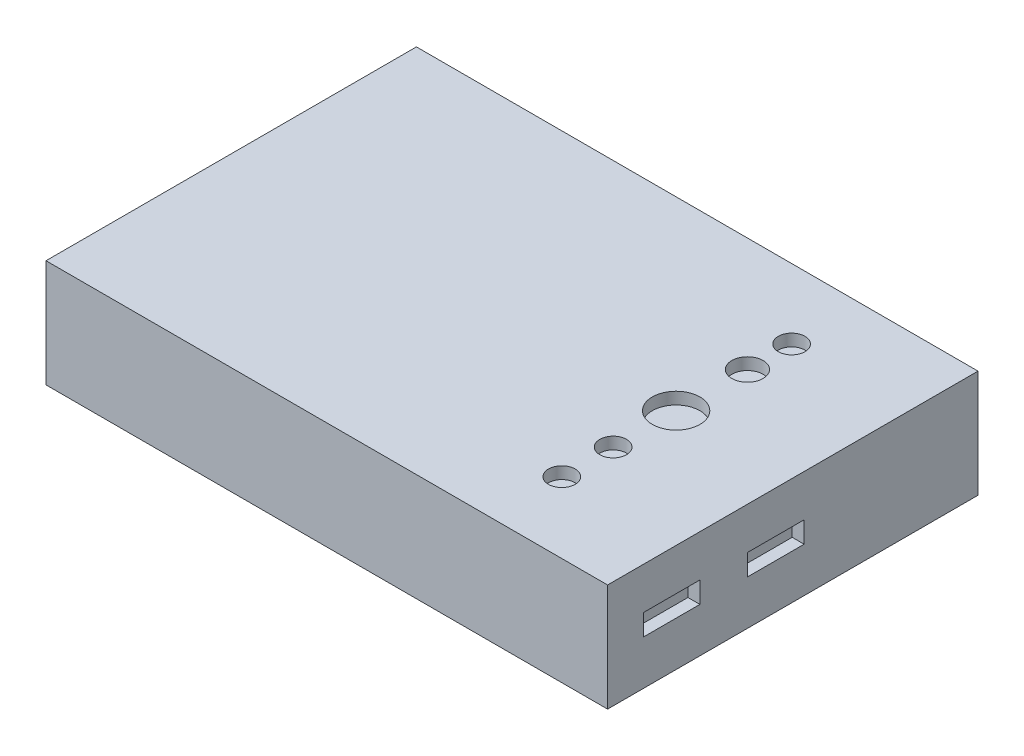
ISO-10303-21;
HEADER;
FILE_DESCRIPTION(('STEP AP214'),'2;1');
FILE_NAME('part.step','',(''),(''),'','','');
FILE_SCHEMA(('AUTOMOTIVE_DESIGN { 1 0 10303 214 1 1 1 1 }'));
ENDSEC;
DATA;
#1=APPLICATION_CONTEXT('core data for automotive mechanical design processes');
#2=APPLICATION_PROTOCOL_DEFINITION('international standard','automotive_design',2000,#1);
#3=PRODUCT_CONTEXT('',#1,'mechanical');
#4=PRODUCT('Part','Part','',(#3));
#5=PRODUCT_RELATED_PRODUCT_CATEGORY('part','',(#4));
#6=PRODUCT_DEFINITION_FORMATION('','',#4);
#7=PRODUCT_DEFINITION_CONTEXT('part definition',#1,'design');
#8=PRODUCT_DEFINITION('design','',#6,#7);
#9=PRODUCT_DEFINITION_SHAPE('','',#8);
#10=(LENGTH_UNIT() NAMED_UNIT(*) SI_UNIT(.MILLI.,.METRE.));
#11=(NAMED_UNIT(*) PLANE_ANGLE_UNIT() SI_UNIT($,.RADIAN.));
#12=(NAMED_UNIT(*) SI_UNIT($,.STERADIAN.) SOLID_ANGLE_UNIT());
#13=UNCERTAINTY_MEASURE_WITH_UNIT(LENGTH_MEASURE(1.E-05),#10,'distance_accuracy_value','');
#14=(GEOMETRIC_REPRESENTATION_CONTEXT(3) GLOBAL_UNCERTAINTY_ASSIGNED_CONTEXT((#13)) GLOBAL_UNIT_ASSIGNED_CONTEXT((#10,
#11,#12)) REPRESENTATION_CONTEXT('',''));
#15=CARTESIAN_POINT('',(0.,0.,0.));
#16=DIRECTION('',(0.,0.,1.));
#17=DIRECTION('',(1.,0.,0.));
#18=AXIS2_PLACEMENT_3D('',#15,#16,#17);
#19=CARTESIAN_POINT('',(0.,22.86,0.));
#20=DIRECTION('',(1.,0.,0.));
#21=DIRECTION('',(0.,0.,-1.));
#22=AXIS2_PLACEMENT_3D('',#19,#20,#21);
#23=PLANE('',#22);
#24=DIRECTION('',(0.,0.,1.));
#25=VECTOR('',#24,1.);
#26=CARTESIAN_POINT('',(0.,0.,0.));
#27=LINE('',#26,#25);
#28=CARTESIAN_POINT('',(0.,0.,-78.74));
#29=VERTEX_POINT('',#28);
#30=CARTESIAN_POINT('',(0.,0.,0.));
#31=VERTEX_POINT('',#30);
#32=EDGE_CURVE('E160',#29,#31,#27,.T.);
#33=ORIENTED_EDGE('',*,*,#32,.T.);
#34=DIRECTION('',(0.,-1.,0.));
#35=VECTOR('',#34,1.);
#36=CARTESIAN_POINT('',(0.,22.86,0.));
#37=LINE('',#36,#35);
#38=CARTESIAN_POINT('',(0.,22.86,0.));
#39=VERTEX_POINT('',#38);
#40=EDGE_CURVE('E11',#39,#31,#37,.T.);
#41=ORIENTED_EDGE('',*,*,#40,.F.);
#42=DIRECTION('',(0.,0.,1.));
#43=VECTOR('',#42,1.);
#44=CARTESIAN_POINT('',(0.,22.86,0.));
#45=LINE('',#44,#43);
#46=CARTESIAN_POINT('',(0.,22.86,-78.74));
#47=VERTEX_POINT('',#46);
#48=EDGE_CURVE('E194',#47,#39,#45,.T.);
#49=ORIENTED_EDGE('',*,*,#48,.F.);
#50=DIRECTION('',(0.,-1.,0.));
#51=VECTOR('',#50,1.);
#52=CARTESIAN_POINT('',(0.,22.86,-78.74));
#53=LINE('',#52,#51);
#54=EDGE_CURVE('E204',#47,#29,#53,.T.);
#55=ORIENTED_EDGE('',*,*,#54,.T.);
#56=EDGE_LOOP('',(#33,#41,#49,#55));
#57=FACE_BOUND('',#56,.T.);
#58=ADVANCED_FACE('F33',(#57),#23,.F.);
#59=CARTESIAN_POINT('',(0.,22.86,0.));
#60=DIRECTION('',(0.,0.,-1.));
#61=DIRECTION('',(-1.,0.,0.));
#62=AXIS2_PLACEMENT_3D('',#59,#60,#61);
#63=PLANE('',#62);
#64=DIRECTION('',(1.,0.,0.));
#65=VECTOR('',#64,1.);
#66=CARTESIAN_POINT('',(0.,0.,0.));
#67=LINE('',#66,#65);
#68=CARTESIAN_POINT('',(119.38,0.,0.));
#69=VERTEX_POINT('',#68);
#70=EDGE_CURVE('E207',#31,#69,#67,.T.);
#71=ORIENTED_EDGE('',*,*,#70,.T.);
#72=DIRECTION('',(0.,-1.,0.));
#73=VECTOR('',#72,1.);
#74=CARTESIAN_POINT('',(119.38,22.86,0.));
#75=LINE('',#74,#73);
#76=CARTESIAN_POINT('',(119.38,22.86,0.));
#77=VERTEX_POINT('',#76);
#78=EDGE_CURVE('E40',#77,#69,#75,.T.);
#79=ORIENTED_EDGE('',*,*,#78,.F.);
#80=DIRECTION('',(1.,0.,0.));
#81=VECTOR('',#80,1.);
#82=CARTESIAN_POINT('',(0.,22.86,0.));
#83=LINE('',#82,#81);
#84=EDGE_CURVE('E197',#39,#77,#83,.T.);
#85=ORIENTED_EDGE('',*,*,#84,.F.);
#86=ORIENTED_EDGE('',*,*,#40,.T.);
#87=EDGE_LOOP('',(#71,#79,#85,#86));
#88=FACE_BOUND('',#87,.T.);
#89=ADVANCED_FACE('F237',(#88),#63,.F.);
#90=CARTESIAN_POINT('',(119.38,22.86,0.));
#91=DIRECTION('',(-1.,0.,0.));
#92=DIRECTION('',(0.,0.,1.));
#93=AXIS2_PLACEMENT_3D('',#90,#91,#92);
#94=PLANE('',#93);
#95=DIRECTION('',(0.,0.,-1.));
#96=VECTOR('',#95,1.);
#97=CARTESIAN_POINT('',(119.38,9.47,-7.62));
#98=LINE('',#97,#96);
#99=CARTESIAN_POINT('',(119.38,9.47,-7.62));
#100=VERTEX_POINT('',#99);
#101=CARTESIAN_POINT('',(119.38,9.47,-19.62));
#102=VERTEX_POINT('',#101);
#103=EDGE_CURVE('E153',#100,#102,#98,.T.);
#104=ORIENTED_EDGE('',*,*,#103,.F.);
#105=DIRECTION('',(0.,-1.,0.));
#106=VECTOR('',#105,1.);
#107=CARTESIAN_POINT('',(119.38,13.97,-7.62));
#108=LINE('',#107,#106);
#109=CARTESIAN_POINT('',(119.38,13.97,-7.62));
#110=VERTEX_POINT('',#109);
#111=EDGE_CURVE('E47',#110,#100,#108,.T.);
#112=ORIENTED_EDGE('',*,*,#111,.F.);
#113=DIRECTION('',(0.,0.,1.));
#114=VECTOR('',#113,1.);
#115=CARTESIAN_POINT('',(119.38,13.97,-7.62));
#116=LINE('',#115,#114);
#117=CARTESIAN_POINT('',(119.38,13.97,-19.62));
#118=VERTEX_POINT('',#117);
#119=EDGE_CURVE('E141',#118,#110,#116,.T.);
#120=ORIENTED_EDGE('',*,*,#119,.F.);
#121=DIRECTION('',(0.,1.,0.));
#122=VECTOR('',#121,1.);
#123=CARTESIAN_POINT('',(119.38,13.97,-19.62));
#124=LINE('',#123,#122);
#125=EDGE_CURVE('E144',#102,#118,#124,.T.);
#126=ORIENTED_EDGE('',*,*,#125,.F.);
#127=EDGE_LOOP('',(#104,#112,#120,#126));
#128=FACE_BOUND('',#127,.T.);
#129=DIRECTION('',(0.,0.,-1.));
#130=VECTOR('',#129,1.);
#131=CARTESIAN_POINT('',(119.38,9.47,-29.78));
#132=LINE('',#131,#130);
#133=CARTESIAN_POINT('',(119.38,9.47,-29.78));
#134=VERTEX_POINT('',#133);
#135=CARTESIAN_POINT('',(119.38,9.47,-41.78));
#136=VERTEX_POINT('',#135);
#137=EDGE_CURVE('E179',#134,#136,#132,.T.);
#138=ORIENTED_EDGE('',*,*,#137,.F.);
#139=DIRECTION('',(0.,-1.,0.));
#140=VECTOR('',#139,1.);
#141=CARTESIAN_POINT('',(119.38,13.97,-29.78));
#142=LINE('',#141,#140);
#143=CARTESIAN_POINT('',(119.38,13.97,-29.78));
#144=VERTEX_POINT('',#143);
#145=EDGE_CURVE('E55',#144,#134,#142,.T.);
#146=ORIENTED_EDGE('',*,*,#145,.F.);
#147=DIRECTION('',(0.,0.,1.));
#148=VECTOR('',#147,1.);
#149=CARTESIAN_POINT('',(119.38,13.97,-29.78));
#150=LINE('',#149,#148);
#151=CARTESIAN_POINT('',(119.38,13.97,-41.78));
#152=VERTEX_POINT('',#151);
#153=EDGE_CURVE('E168',#152,#144,#150,.T.);
#154=ORIENTED_EDGE('',*,*,#153,.F.);
#155=DIRECTION('',(0.,1.,0.));
#156=VECTOR('',#155,1.);
#157=CARTESIAN_POINT('',(119.38,13.97,-41.78));
#158=LINE('',#157,#156);
#159=EDGE_CURVE('E183',#136,#152,#158,.T.);
#160=ORIENTED_EDGE('',*,*,#159,.F.);
#161=EDGE_LOOP('',(#138,#146,#154,#160));
#162=FACE_BOUND('',#161,.T.);
#163=DIRECTION('',(0.,0.,-1.));
#164=VECTOR('',#163,1.);
#165=CARTESIAN_POINT('',(119.38,0.,0.));
#166=LINE('',#165,#164);
#167=CARTESIAN_POINT('',(119.38,0.,-78.74));
#168=VERTEX_POINT('',#167);
#169=EDGE_CURVE('E209',#69,#168,#166,.T.);
#170=ORIENTED_EDGE('',*,*,#169,.T.);
#171=DIRECTION('',(0.,-1.,0.));
#172=VECTOR('',#171,1.);
#173=CARTESIAN_POINT('',(119.38,22.86,-78.74));
#174=LINE('',#173,#172);
#175=CARTESIAN_POINT('',(119.38,22.86,-78.74));
#176=VERTEX_POINT('',#175);
#177=EDGE_CURVE('E214',#176,#168,#174,.T.);
#178=ORIENTED_EDGE('',*,*,#177,.F.);
#179=DIRECTION('',(0.,0.,-1.));
#180=VECTOR('',#179,1.);
#181=CARTESIAN_POINT('',(119.38,22.86,0.));
#182=LINE('',#181,#180);
#183=EDGE_CURVE('E200',#77,#176,#182,.T.);
#184=ORIENTED_EDGE('',*,*,#183,.F.);
#185=ORIENTED_EDGE('',*,*,#78,.T.);
#186=EDGE_LOOP('',(#170,#178,#184,#185));
#187=FACE_BOUND('',#186,.T.);
#188=ADVANCED_FACE('F221',(#128,#162,#187),#94,.F.);
#189=CARTESIAN_POINT('',(0.,22.86,-78.74));
#190=DIRECTION('',(0.,0.,1.));
#191=DIRECTION('',(1.,0.,0.));
#192=AXIS2_PLACEMENT_3D('',#189,#190,#191);
#193=PLANE('',#192);
#194=DIRECTION('',(-1.,0.,0.));
#195=VECTOR('',#194,1.);
#196=CARTESIAN_POINT('',(0.,0.,-78.74));
#197=LINE('',#196,#195);
#198=EDGE_CURVE('E198',#168,#29,#197,.T.);
#199=ORIENTED_EDGE('',*,*,#198,.T.);
#200=ORIENTED_EDGE('',*,*,#54,.F.);
#201=DIRECTION('',(-1.,0.,0.));
#202=VECTOR('',#201,1.);
#203=CARTESIAN_POINT('',(0.,22.86,-78.74));
#204=LINE('',#203,#202);
#205=EDGE_CURVE('E202',#176,#47,#204,.T.);
#206=ORIENTED_EDGE('',*,*,#205,.F.);
#207=ORIENTED_EDGE('',*,*,#177,.T.);
#208=EDGE_LOOP('',(#199,#200,#206,#207));
#209=FACE_BOUND('',#208,.T.);
#210=ADVANCED_FACE('F230',(#209),#193,.F.);
#211=CARTESIAN_POINT('',(0.,22.86,0.));
#212=DIRECTION('',(0.,-1.,0.));
#213=DIRECTION('',(0.,0.,-1.));
#214=AXIS2_PLACEMENT_3D('',#211,#212,#213);
#215=PLANE('',#214);
#216=CARTESIAN_POINT('',(94.5792176740278,22.86,-15.0744175106316));
#217=DIRECTION('',(0.,1.,0.));
#218=DIRECTION('',(0.,0.,1.));
#219=AXIS2_PLACEMENT_3D('',#216,#217,#218);
#220=CIRCLE('',#219,2.83689681457869);
#221=CARTESIAN_POINT('',(94.5792176740278,22.86,-12.2375206960529));
#222=VERTEX_POINT('',#221);
#223=EDGE_CURVE('E351',#222,#222,#220,.T.);
#224=ORIENTED_EDGE('',*,*,#223,.F.);
#225=EDGE_LOOP('',(#224));
#226=FACE_BOUND('',#225,.T.);
#227=CARTESIAN_POINT('',(94.5792176740278,22.86,-25.9852274014185));
#228=DIRECTION('',(0.,1.,0.));
#229=DIRECTION('',(0.,0.,1.));
#230=AXIS2_PLACEMENT_3D('',#227,#228,#229);
#231=CIRCLE('',#230,2.83689681457869);
#232=CARTESIAN_POINT('',(94.5792176740278,22.86,-23.1483305868398));
#233=VERTEX_POINT('',#232);
#234=EDGE_CURVE('E345',#233,#233,#231,.T.);
#235=ORIENTED_EDGE('',*,*,#234,.F.);
#236=EDGE_LOOP('',(#235));
#237=FACE_BOUND('',#236,.T.);
#238=CARTESIAN_POINT('',(94.5792176740278,22.86,-63.9193222542705));
#239=DIRECTION('',(0.,1.,0.));
#240=DIRECTION('',(0.,0.,1.));
#241=AXIS2_PLACEMENT_3D('',#238,#239,#240);
#242=CIRCLE('',#241,2.83689681457869);
#243=CARTESIAN_POINT('',(94.5792176740278,22.86,-61.0824254396919));
#244=VERTEX_POINT('',#243);
#245=EDGE_CURVE('E339',#244,#244,#242,.T.);
#246=ORIENTED_EDGE('',*,*,#245,.F.);
#247=EDGE_LOOP('',(#246));
#248=FACE_BOUND('',#247,.T.);
#249=CARTESIAN_POINT('',(94.5792176740278,22.86,-54.5309509528958));
#250=DIRECTION('',(0.,1.,0.));
#251=DIRECTION('',(0.,0.,1.));
#252=AXIS2_PLACEMENT_3D('',#249,#250,#251);
#253=CIRCLE('',#252,3.32050258923197);
#254=CARTESIAN_POINT('',(94.5792176740278,22.86,-51.2104483636638));
#255=VERTEX_POINT('',#254);
#256=EDGE_CURVE('E330',#255,#255,#253,.T.);
#257=ORIENTED_EDGE('',*,*,#256,.F.);
#258=EDGE_LOOP('',(#257));
#259=FACE_BOUND('',#258,.T.);
#260=CARTESIAN_POINT('',(94.5792176740278,22.86,-39.37));
#261=DIRECTION('',(0.,1.,0.));
#262=DIRECTION('',(0.,0.,1.));
#263=AXIS2_PLACEMENT_3D('',#260,#261,#262);
#264=CIRCLE('',#263,5.06527111955265);
#265=CARTESIAN_POINT('',(94.5792176740278,22.86,-34.3047288804473));
#266=VERTEX_POINT('',#265);
#267=EDGE_CURVE('E147',#266,#266,#264,.T.);
#268=ORIENTED_EDGE('',*,*,#267,.F.);
#269=EDGE_LOOP('',(#268));
#270=FACE_BOUND('',#269,.T.);
#271=ORIENTED_EDGE('',*,*,#48,.T.);
#272=ORIENTED_EDGE('',*,*,#84,.T.);
#273=ORIENTED_EDGE('',*,*,#183,.T.);
#274=ORIENTED_EDGE('',*,*,#205,.T.);
#275=EDGE_LOOP('',(#271,#272,#273,#274));
#276=FACE_BOUND('',#275,.T.);
#277=ADVANCED_FACE('F236',(#226,#237,#248,#259,#270,#276),#215,.F.);
#278=CARTESIAN_POINT('',(0.,0.,0.));
#279=DIRECTION('',(0.,-1.,0.));
#280=DIRECTION('',(0.,0.,-1.));
#281=AXIS2_PLACEMENT_3D('',#278,#279,#280);
#282=PLANE('',#281);
#283=ORIENTED_EDGE('',*,*,#32,.F.);
#284=ORIENTED_EDGE('',*,*,#198,.F.);
#285=ORIENTED_EDGE('',*,*,#169,.F.);
#286=ORIENTED_EDGE('',*,*,#70,.F.);
#287=EDGE_LOOP('',(#283,#284,#285,#286));
#288=FACE_BOUND('',#287,.T.);
#289=ADVANCED_FACE('F227',(#288),#282,.T.);
#290=CARTESIAN_POINT('',(116.84,13.97,-29.78));
#291=DIRECTION('',(0.,0.,1.));
#292=DIRECTION('',(1.,0.,0.));
#293=AXIS2_PLACEMENT_3D('',#290,#291,#292);
#294=PLANE('',#293);
#295=ORIENTED_EDGE('',*,*,#145,.T.);
#296=DIRECTION('',(1.,0.,0.));
#297=VECTOR('',#296,1.);
#298=CARTESIAN_POINT('',(116.84,9.47,-29.78));
#299=LINE('',#298,#297);
#300=CARTESIAN_POINT('',(116.84,9.47,-29.78));
#301=VERTEX_POINT('',#300);
#302=EDGE_CURVE('E177',#301,#134,#299,.T.);
#303=ORIENTED_EDGE('',*,*,#302,.F.);
#304=DIRECTION('',(0.,-1.,0.));
#305=VECTOR('',#304,1.);
#306=CARTESIAN_POINT('',(116.84,13.97,-29.78));
#307=LINE('',#306,#305);
#308=CARTESIAN_POINT('',(116.84,13.97,-29.78));
#309=VERTEX_POINT('',#308);
#310=EDGE_CURVE('E164',#309,#301,#307,.T.);
#311=ORIENTED_EDGE('',*,*,#310,.F.);
#312=DIRECTION('',(1.,0.,0.));
#313=VECTOR('',#312,1.);
#314=CARTESIAN_POINT('',(116.84,13.97,-29.78));
#315=LINE('',#314,#313);
#316=EDGE_CURVE('E154',#309,#144,#315,.T.);
#317=ORIENTED_EDGE('',*,*,#316,.T.);
#318=EDGE_LOOP('',(#295,#303,#311,#317));
#319=FACE_BOUND('',#318,.T.);
#320=ADVANCED_FACE('F250',(#319),#294,.F.);
#321=CARTESIAN_POINT('',(116.84,13.97,-29.78));
#322=DIRECTION('',(0.,1.,0.));
#323=DIRECTION('',(0.,0.,1.));
#324=AXIS2_PLACEMENT_3D('',#321,#322,#323);
#325=PLANE('',#324);
#326=ORIENTED_EDGE('',*,*,#153,.T.);
#327=ORIENTED_EDGE('',*,*,#316,.F.);
#328=DIRECTION('',(0.,0.,1.));
#329=VECTOR('',#328,1.);
#330=CARTESIAN_POINT('',(116.84,13.97,-29.78));
#331=LINE('',#330,#329);
#332=CARTESIAN_POINT('',(116.84,13.97,-41.78));
#333=VERTEX_POINT('',#332);
#334=EDGE_CURVE('E174',#333,#309,#331,.T.);
#335=ORIENTED_EDGE('',*,*,#334,.F.);
#336=DIRECTION('',(1.,0.,0.));
#337=VECTOR('',#336,1.);
#338=CARTESIAN_POINT('',(116.84,13.97,-41.78));
#339=LINE('',#338,#337);
#340=EDGE_CURVE('E189',#333,#152,#339,.T.);
#341=ORIENTED_EDGE('',*,*,#340,.T.);
#342=EDGE_LOOP('',(#326,#327,#335,#341));
#343=FACE_BOUND('',#342,.T.);
#344=ADVANCED_FACE('F256',(#343),#325,.F.);
#345=CARTESIAN_POINT('',(116.84,13.97,-41.78));
#346=DIRECTION('',(0.,0.,-1.));
#347=DIRECTION('',(-1.,0.,0.));
#348=AXIS2_PLACEMENT_3D('',#345,#346,#347);
#349=PLANE('',#348);
#350=ORIENTED_EDGE('',*,*,#159,.T.);
#351=ORIENTED_EDGE('',*,*,#340,.F.);
#352=DIRECTION('',(0.,1.,0.));
#353=VECTOR('',#352,1.);
#354=CARTESIAN_POINT('',(116.84,13.97,-41.78));
#355=LINE('',#354,#353);
#356=CARTESIAN_POINT('',(116.84,9.47,-41.78));
#357=VERTEX_POINT('',#356);
#358=EDGE_CURVE('E171',#357,#333,#355,.T.);
#359=ORIENTED_EDGE('',*,*,#358,.F.);
#360=DIRECTION('',(1.,0.,0.));
#361=VECTOR('',#360,1.);
#362=CARTESIAN_POINT('',(116.84,9.47,-41.78));
#363=LINE('',#362,#361);
#364=EDGE_CURVE('E191',#357,#136,#363,.T.);
#365=ORIENTED_EDGE('',*,*,#364,.T.);
#366=EDGE_LOOP('',(#350,#351,#359,#365));
#367=FACE_BOUND('',#366,.T.);
#368=ADVANCED_FACE('F261',(#367),#349,.F.);
#369=CARTESIAN_POINT('',(116.84,9.47,-29.78));
#370=DIRECTION('',(0.,-1.,0.));
#371=DIRECTION('',(0.,0.,-1.));
#372=AXIS2_PLACEMENT_3D('',#369,#370,#371);
#373=PLANE('',#372);
#374=ORIENTED_EDGE('',*,*,#137,.T.);
#375=ORIENTED_EDGE('',*,*,#364,.F.);
#376=DIRECTION('',(0.,0.,-1.));
#377=VECTOR('',#376,1.);
#378=CARTESIAN_POINT('',(116.84,9.47,-29.78));
#379=LINE('',#378,#377);
#380=EDGE_CURVE('E167',#301,#357,#379,.T.);
#381=ORIENTED_EDGE('',*,*,#380,.F.);
#382=ORIENTED_EDGE('',*,*,#302,.T.);
#383=EDGE_LOOP('',(#374,#375,#381,#382));
#384=FACE_BOUND('',#383,.T.);
#385=ADVANCED_FACE('F257',(#384),#373,.F.);
#386=CARTESIAN_POINT('',(116.84,0.,0.));
#387=DIRECTION('',(1.,0.,0.));
#388=DIRECTION('',(0.,0.,-1.));
#389=AXIS2_PLACEMENT_3D('',#386,#387,#388);
#390=PLANE('',#389);
#391=ORIENTED_EDGE('',*,*,#310,.T.);
#392=ORIENTED_EDGE('',*,*,#380,.T.);
#393=ORIENTED_EDGE('',*,*,#358,.T.);
#394=ORIENTED_EDGE('',*,*,#334,.T.);
#395=EDGE_LOOP('',(#391,#392,#393,#394));
#396=FACE_BOUND('',#395,.T.);
#397=ADVANCED_FACE('F260',(#396),#390,.T.);
#398=CARTESIAN_POINT('',(116.84,13.97,-7.62));
#399=DIRECTION('',(0.,0.,1.));
#400=DIRECTION('',(0.,-1.,0.));
#401=AXIS2_PLACEMENT_3D('',#398,#399,#400);
#402=PLANE('',#401);
#403=ORIENTED_EDGE('',*,*,#111,.T.);
#404=DIRECTION('',(1.,0.,0.));
#405=VECTOR('',#404,1.);
#406=CARTESIAN_POINT('',(116.84,9.47,-7.62));
#407=LINE('',#406,#405);
#408=CARTESIAN_POINT('',(116.84,9.47,-7.62));
#409=VERTEX_POINT('',#408);
#410=EDGE_CURVE('E119',#409,#100,#407,.T.);
#411=ORIENTED_EDGE('',*,*,#410,.F.);
#412=DIRECTION('',(0.,-1.,0.));
#413=VECTOR('',#412,1.);
#414=CARTESIAN_POINT('',(116.84,13.97,-7.62));
#415=LINE('',#414,#413);
#416=CARTESIAN_POINT('',(116.84,13.97,-7.62));
#417=VERTEX_POINT('',#416);
#418=EDGE_CURVE('E123',#417,#409,#415,.T.);
#419=ORIENTED_EDGE('',*,*,#418,.F.);
#420=DIRECTION('',(1.,0.,0.));
#421=VECTOR('',#420,1.);
#422=CARTESIAN_POINT('',(116.84,13.97,-7.62));
#423=LINE('',#422,#421);
#424=EDGE_CURVE('E158',#417,#110,#423,.T.);
#425=ORIENTED_EDGE('',*,*,#424,.T.);
#426=EDGE_LOOP('',(#403,#411,#419,#425));
#427=FACE_BOUND('',#426,.T.);
#428=ADVANCED_FACE('F121',(#427),#402,.F.);
#429=CARTESIAN_POINT('',(116.84,13.97,-7.62));
#430=DIRECTION('',(0.,1.,0.));
#431=DIRECTION('',(0.,0.,1.));
#432=AXIS2_PLACEMENT_3D('',#429,#430,#431);
#433=PLANE('',#432);
#434=ORIENTED_EDGE('',*,*,#119,.T.);
#435=ORIENTED_EDGE('',*,*,#424,.F.);
#436=DIRECTION('',(0.,0.,1.));
#437=VECTOR('',#436,1.);
#438=CARTESIAN_POINT('',(116.84,13.97,-7.62));
#439=LINE('',#438,#437);
#440=CARTESIAN_POINT('',(116.84,13.97,-19.62));
#441=VERTEX_POINT('',#440);
#442=EDGE_CURVE('E129',#441,#417,#439,.T.);
#443=ORIENTED_EDGE('',*,*,#442,.F.);
#444=DIRECTION('',(1.,0.,0.));
#445=VECTOR('',#444,1.);
#446=CARTESIAN_POINT('',(116.84,13.97,-19.62));
#447=LINE('',#446,#445);
#448=EDGE_CURVE('E161',#441,#118,#447,.T.);
#449=ORIENTED_EDGE('',*,*,#448,.T.);
#450=EDGE_LOOP('',(#434,#435,#443,#449));
#451=FACE_BOUND('',#450,.T.);
#452=ADVANCED_FACE('F274',(#451),#433,.F.);
#453=CARTESIAN_POINT('',(116.84,13.97,-19.62));
#454=DIRECTION('',(0.,0.,-1.));
#455=DIRECTION('',(0.,1.,0.));
#456=AXIS2_PLACEMENT_3D('',#453,#454,#455);
#457=PLANE('',#456);
#458=ORIENTED_EDGE('',*,*,#125,.T.);
#459=ORIENTED_EDGE('',*,*,#448,.F.);
#460=DIRECTION('',(0.,1.,0.));
#461=VECTOR('',#460,1.);
#462=CARTESIAN_POINT('',(116.84,13.97,-19.62));
#463=LINE('',#462,#461);
#464=CARTESIAN_POINT('',(116.84,9.47,-19.62));
#465=VERTEX_POINT('',#464);
#466=EDGE_CURVE('E137',#465,#441,#463,.T.);
#467=ORIENTED_EDGE('',*,*,#466,.F.);
#468=DIRECTION('',(1.,0.,0.));
#469=VECTOR('',#468,1.);
#470=CARTESIAN_POINT('',(116.84,9.47,-19.62));
#471=LINE('',#470,#469);
#472=EDGE_CURVE('E128',#465,#102,#471,.T.);
#473=ORIENTED_EDGE('',*,*,#472,.T.);
#474=EDGE_LOOP('',(#458,#459,#467,#473));
#475=FACE_BOUND('',#474,.T.);
#476=ADVANCED_FACE('F277',(#475),#457,.F.);
#477=CARTESIAN_POINT('',(116.84,9.47,-7.62));
#478=DIRECTION('',(0.,-1.,0.));
#479=DIRECTION('',(0.,0.,-1.));
#480=AXIS2_PLACEMENT_3D('',#477,#478,#479);
#481=PLANE('',#480);
#482=ORIENTED_EDGE('',*,*,#103,.T.);
#483=ORIENTED_EDGE('',*,*,#472,.F.);
#484=DIRECTION('',(0.,0.,-1.));
#485=VECTOR('',#484,1.);
#486=CARTESIAN_POINT('',(116.84,9.47,-7.62));
#487=LINE('',#486,#485);
#488=EDGE_CURVE('E132',#409,#465,#487,.T.);
#489=ORIENTED_EDGE('',*,*,#488,.F.);
#490=ORIENTED_EDGE('',*,*,#410,.T.);
#491=EDGE_LOOP('',(#482,#483,#489,#490));
#492=FACE_BOUND('',#491,.T.);
#493=ADVANCED_FACE('F133',(#492),#481,.F.);
#494=CARTESIAN_POINT('',(116.84,0.,0.));
#495=DIRECTION('',(1.,0.,0.));
#496=DIRECTION('',(0.,0.,-1.));
#497=AXIS2_PLACEMENT_3D('',#494,#495,#496);
#498=PLANE('',#497);
#499=ORIENTED_EDGE('',*,*,#418,.T.);
#500=ORIENTED_EDGE('',*,*,#488,.T.);
#501=ORIENTED_EDGE('',*,*,#466,.T.);
#502=ORIENTED_EDGE('',*,*,#442,.T.);
#503=EDGE_LOOP('',(#499,#500,#501,#502));
#504=FACE_BOUND('',#503,.T.);
#505=ADVANCED_FACE('F139',(#504),#498,.T.);
#506=CARTESIAN_POINT('',(94.5792176740278,20.32,-39.37));
#507=DIRECTION('',(0.,1.,0.));
#508=DIRECTION('',(0.,0.,1.));
#509=AXIS2_PLACEMENT_3D('',#506,#507,#508);
#510=CYLINDRICAL_SURFACE('',#509,5.06527111955265);
#511=CARTESIAN_POINT('',(94.5792176740278,20.32,-39.37));
#512=DIRECTION('',(0.,1.,0.));
#513=DIRECTION('',(0.,0.,1.));
#514=AXIS2_PLACEMENT_3D('',#511,#512,#513);
#515=CIRCLE('',#514,5.06527111955265);
#516=CARTESIAN_POINT('',(94.5792176740278,20.32,-34.3047288804473));
#517=VERTEX_POINT('',#516);
#518=EDGE_CURVE('E180',#517,#517,#515,.T.);
#519=ORIENTED_EDGE('',*,*,#518,.F.);
#520=EDGE_LOOP('',(#519));
#521=FACE_BOUND('',#520,.T.);
#522=ORIENTED_EDGE('',*,*,#267,.T.);
#523=EDGE_LOOP('',(#522));
#524=FACE_BOUND('',#523,.T.);
#525=ADVANCED_FACE('F286',(#521,#524),#510,.F.);
#526=CARTESIAN_POINT('',(94.5792176740278,20.32,-39.37));
#527=DIRECTION('',(0.,1.,0.));
#528=DIRECTION('',(0.,0.,1.));
#529=AXIS2_PLACEMENT_3D('',#526,#527,#528);
#530=PLANE('',#529);
#531=ORIENTED_EDGE('',*,*,#518,.T.);
#532=EDGE_LOOP('',(#531));
#533=FACE_BOUND('',#532,.T.);
#534=ADVANCED_FACE('F289',(#533),#530,.T.);
#535=CARTESIAN_POINT('',(94.5792176740278,20.32,-54.5309509528958));
#536=DIRECTION('',(0.,1.,0.));
#537=DIRECTION('',(0.,0.,1.));
#538=AXIS2_PLACEMENT_3D('',#535,#536,#537);
#539=CYLINDRICAL_SURFACE('',#538,3.32050258923197);
#540=CARTESIAN_POINT('',(94.5792176740278,20.32,-54.5309509528958));
#541=DIRECTION('',(0.,1.,0.));
#542=DIRECTION('',(0.,0.,1.));
#543=AXIS2_PLACEMENT_3D('',#540,#541,#542);
#544=CIRCLE('',#543,3.32050258923197);
#545=CARTESIAN_POINT('',(94.5792176740278,20.32,-51.2104483636638));
#546=VERTEX_POINT('',#545);
#547=EDGE_CURVE('E329',#546,#546,#544,.T.);
#548=ORIENTED_EDGE('',*,*,#547,.F.);
#549=EDGE_LOOP('',(#548));
#550=FACE_BOUND('',#549,.T.);
#551=ORIENTED_EDGE('',*,*,#256,.T.);
#552=EDGE_LOOP('',(#551));
#553=FACE_BOUND('',#552,.T.);
#554=ADVANCED_FACE('F293',(#550,#553),#539,.F.);
#555=CARTESIAN_POINT('',(94.5792176740278,20.32,-54.5309509528958));
#556=DIRECTION('',(0.,1.,0.));
#557=DIRECTION('',(0.,0.,1.));
#558=AXIS2_PLACEMENT_3D('',#555,#556,#557);
#559=PLANE('',#558);
#560=ORIENTED_EDGE('',*,*,#547,.T.);
#561=EDGE_LOOP('',(#560));
#562=FACE_BOUND('',#561,.T.);
#563=ADVANCED_FACE('F315',(#562),#559,.T.);
#564=CARTESIAN_POINT('',(94.5792176740278,20.32,-63.9193222542705));
#565=DIRECTION('',(0.,1.,0.));
#566=DIRECTION('',(0.,0.,1.));
#567=AXIS2_PLACEMENT_3D('',#564,#565,#566);
#568=CYLINDRICAL_SURFACE('',#567,2.83689681457869);
#569=CARTESIAN_POINT('',(94.5792176740278,20.32,-63.9193222542705));
#570=DIRECTION('',(0.,1.,0.));
#571=DIRECTION('',(0.,0.,1.));
#572=AXIS2_PLACEMENT_3D('',#569,#570,#571);
#573=CIRCLE('',#572,2.83689681457869);
#574=CARTESIAN_POINT('',(94.5792176740278,20.32,-61.0824254396919));
#575=VERTEX_POINT('',#574);
#576=EDGE_CURVE('E334',#575,#575,#573,.T.);
#577=ORIENTED_EDGE('',*,*,#576,.F.);
#578=EDGE_LOOP('',(#577));
#579=FACE_BOUND('',#578,.T.);
#580=ORIENTED_EDGE('',*,*,#245,.T.);
#581=EDGE_LOOP('',(#580));
#582=FACE_BOUND('',#581,.T.);
#583=ADVANCED_FACE('F312',(#579,#582),#568,.F.);
#584=CARTESIAN_POINT('',(94.5792176740278,20.32,-63.9193222542705));
#585=DIRECTION('',(0.,1.,0.));
#586=DIRECTION('',(0.,0.,1.));
#587=AXIS2_PLACEMENT_3D('',#584,#585,#586);
#588=PLANE('',#587);
#589=ORIENTED_EDGE('',*,*,#576,.T.);
#590=EDGE_LOOP('',(#589));
#591=FACE_BOUND('',#590,.T.);
#592=ADVANCED_FACE('F307',(#591),#588,.T.);
#593=CARTESIAN_POINT('',(94.5792176740278,20.32,-25.9852274014185));
#594=DIRECTION('',(0.,1.,0.));
#595=DIRECTION('',(0.,0.,1.));
#596=AXIS2_PLACEMENT_3D('',#593,#594,#595);
#597=CYLINDRICAL_SURFACE('',#596,2.83689681457869);
#598=CARTESIAN_POINT('',(94.5792176740278,20.32,-25.9852274014185));
#599=DIRECTION('',(0.,1.,0.));
#600=DIRECTION('',(0.,0.,1.));
#601=AXIS2_PLACEMENT_3D('',#598,#599,#600);
#602=CIRCLE('',#601,2.83689681457869);
#603=CARTESIAN_POINT('',(94.5792176740278,20.32,-23.1483305868398));
#604=VERTEX_POINT('',#603);
#605=EDGE_CURVE('E342',#604,#604,#602,.T.);
#606=ORIENTED_EDGE('',*,*,#605,.F.);
#607=EDGE_LOOP('',(#606));
#608=FACE_BOUND('',#607,.T.);
#609=ORIENTED_EDGE('',*,*,#234,.T.);
#610=EDGE_LOOP('',(#609));
#611=FACE_BOUND('',#610,.T.);
#612=ADVANCED_FACE('F304',(#608,#611),#597,.F.);
#613=CARTESIAN_POINT('',(94.5792176740278,20.32,-25.9852274014185));
#614=DIRECTION('',(0.,1.,0.));
#615=DIRECTION('',(0.,0.,1.));
#616=AXIS2_PLACEMENT_3D('',#613,#614,#615);
#617=PLANE('',#616);
#618=ORIENTED_EDGE('',*,*,#605,.T.);
#619=EDGE_LOOP('',(#618));
#620=FACE_BOUND('',#619,.T.);
#621=ADVANCED_FACE('F299',(#620),#617,.T.);
#622=CARTESIAN_POINT('',(94.5792176740278,20.32,-15.0744175106316));
#623=DIRECTION('',(0.,1.,0.));
#624=DIRECTION('',(0.,0.,1.));
#625=AXIS2_PLACEMENT_3D('',#622,#623,#624);
#626=CYLINDRICAL_SURFACE('',#625,2.83689681457869);
#627=CARTESIAN_POINT('',(94.5792176740278,20.32,-15.0744175106316));
#628=DIRECTION('',(0.,1.,0.));
#629=DIRECTION('',(0.,0.,1.));
#630=AXIS2_PLACEMENT_3D('',#627,#628,#629);
#631=CIRCLE('',#630,2.83689681457869);
#632=CARTESIAN_POINT('',(94.5792176740278,20.32,-12.2375206960529));
#633=VERTEX_POINT('',#632);
#634=EDGE_CURVE('E348',#633,#633,#631,.T.);
#635=ORIENTED_EDGE('',*,*,#634,.F.);
#636=EDGE_LOOP('',(#635));
#637=FACE_BOUND('',#636,.T.);
#638=ORIENTED_EDGE('',*,*,#223,.T.);
#639=EDGE_LOOP('',(#638));
#640=FACE_BOUND('',#639,.T.);
#641=ADVANCED_FACE('F295',(#637,#640),#626,.F.);
#642=CARTESIAN_POINT('',(94.5792176740278,20.32,-15.0744175106316));
#643=DIRECTION('',(0.,1.,0.));
#644=DIRECTION('',(0.,0.,1.));
#645=AXIS2_PLACEMENT_3D('',#642,#643,#644);
#646=PLANE('',#645);
#647=ORIENTED_EDGE('',*,*,#634,.T.);
#648=EDGE_LOOP('',(#647));
#649=FACE_BOUND('',#648,.T.);
#650=ADVANCED_FACE('F298',(#649),#646,.T.);
#651=CLOSED_SHELL('',(#58,#89,#188,#210,#277,#289,#320,#344,#368,#385,#397,#428,#452,#476,#493,
#505,#525,#534,#554,#563,#583,#592,#612,#621,#641,#650));
#652=MANIFOLD_SOLID_BREP('B2',#651);
#653=ADVANCED_BREP_SHAPE_REPRESENTATION('',(#18,#652),#14);
#654=SHAPE_DEFINITION_REPRESENTATION(#9,#653);
ENDSEC;
END-ISO-10303-21;
